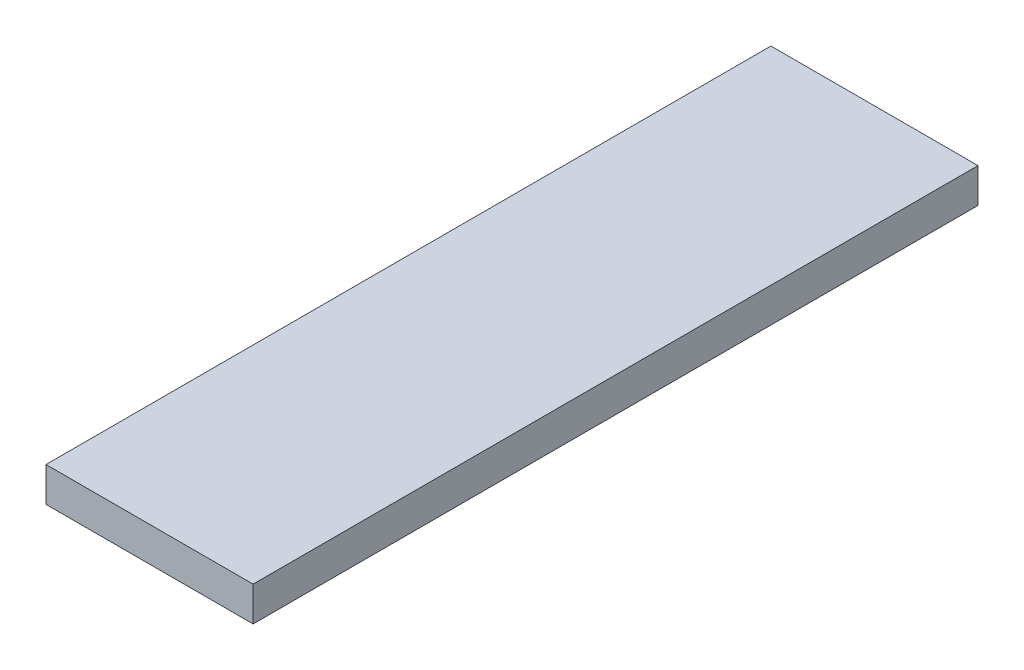
ISO-10303-21;
HEADER;
FILE_DESCRIPTION(('STEP AP214'),'2;1');
FILE_NAME('part.step','',(''),(''),'','','');
FILE_SCHEMA(('AUTOMOTIVE_DESIGN { 1 0 10303 214 1 1 1 1 }'));
ENDSEC;
DATA;
#1=APPLICATION_CONTEXT('core data for automotive mechanical design processes');
#2=APPLICATION_PROTOCOL_DEFINITION('international standard','automotive_design',2000,#1);
#3=PRODUCT_CONTEXT('',#1,'mechanical');
#4=PRODUCT('Part','Part','',(#3));
#5=PRODUCT_RELATED_PRODUCT_CATEGORY('part','',(#4));
#6=PRODUCT_DEFINITION_FORMATION('','',#4);
#7=PRODUCT_DEFINITION_CONTEXT('part definition',#1,'design');
#8=PRODUCT_DEFINITION('design','',#6,#7);
#9=PRODUCT_DEFINITION_SHAPE('','',#8);
#10=(LENGTH_UNIT() NAMED_UNIT(*) SI_UNIT(.MILLI.,.METRE.));
#11=(NAMED_UNIT(*) PLANE_ANGLE_UNIT() SI_UNIT($,.RADIAN.));
#12=(NAMED_UNIT(*) SI_UNIT($,.STERADIAN.) SOLID_ANGLE_UNIT());
#13=UNCERTAINTY_MEASURE_WITH_UNIT(LENGTH_MEASURE(1.E-05),#10,'distance_accuracy_value','');
#14=(GEOMETRIC_REPRESENTATION_CONTEXT(3) GLOBAL_UNCERTAINTY_ASSIGNED_CONTEXT((#13)) GLOBAL_UNIT_ASSIGNED_CONTEXT((#10,
#11,#12)) REPRESENTATION_CONTEXT('',''));
#15=CARTESIAN_POINT('',(0.,0.,0.));
#16=DIRECTION('',(0.,0.,1.));
#17=DIRECTION('',(1.,0.,0.));
#18=AXIS2_PLACEMENT_3D('',#15,#16,#17);
#19=CARTESIAN_POINT('',(0.,0.,53.34));
#20=DIRECTION('',(-1.,0.,0.));
#21=DIRECTION('',(0.,-1.,0.));
#22=AXIS2_PLACEMENT_3D('',#19,#20,#21);
#23=PLANE('',#22);
#24=DIRECTION('',(0.,1.,0.));
#25=VECTOR('',#24,1.);
#26=CARTESIAN_POINT('',(0.,0.,0.));
#27=LINE('',#26,#25);
#28=CARTESIAN_POINT('',(0.,0.,0.));
#29=VERTEX_POINT('',#28);
#30=CARTESIAN_POINT('',(0.,2.54,0.));
#31=VERTEX_POINT('',#30);
#32=EDGE_CURVE('E106',#29,#31,#27,.T.);
#33=ORIENTED_EDGE('',*,*,#32,.T.);
#34=DIRECTION('',(0.,0.,-1.));
#35=VECTOR('',#34,1.);
#36=CARTESIAN_POINT('',(0.,2.54,53.34));
#37=LINE('',#36,#35);
#38=CARTESIAN_POINT('',(0.,2.54,53.34));
#39=VERTEX_POINT('',#38);
#40=EDGE_CURVE('E11',#39,#31,#37,.T.);
#41=ORIENTED_EDGE('',*,*,#40,.F.);
#42=DIRECTION('',(0.,1.,0.));
#43=VECTOR('',#42,1.);
#44=CARTESIAN_POINT('',(0.,0.,53.34));
#45=LINE('',#44,#43);
#46=CARTESIAN_POINT('',(0.,0.,53.34));
#47=VERTEX_POINT('',#46);
#48=EDGE_CURVE('E90',#47,#39,#45,.T.);
#49=ORIENTED_EDGE('',*,*,#48,.F.);
#50=DIRECTION('',(0.,0.,-1.));
#51=VECTOR('',#50,1.);
#52=CARTESIAN_POINT('',(0.,0.,53.34));
#53=LINE('',#52,#51);
#54=EDGE_CURVE('E102',#47,#29,#53,.T.);
#55=ORIENTED_EDGE('',*,*,#54,.T.);
#56=EDGE_LOOP('',(#33,#41,#49,#55));
#57=FACE_BOUND('',#56,.T.);
#58=ADVANCED_FACE('F38',(#57),#23,.F.);
#59=CARTESIAN_POINT('',(0.,2.54,53.34));
#60=DIRECTION('',(0.,-1.,0.));
#61=DIRECTION('',(1.,0.,0.));
#62=AXIS2_PLACEMENT_3D('',#59,#60,#61);
#63=PLANE('',#62);
#64=DIRECTION('',(-1.,0.,0.));
#65=VECTOR('',#64,1.);
#66=CARTESIAN_POINT('',(0.,2.54,0.));
#67=LINE('',#66,#65);
#68=CARTESIAN_POINT('',(-15.24,2.54,0.));
#69=VERTEX_POINT('',#68);
#70=EDGE_CURVE('E95',#31,#69,#67,.T.);
#71=ORIENTED_EDGE('',*,*,#70,.T.);
#72=DIRECTION('',(0.,0.,-1.));
#73=VECTOR('',#72,1.);
#74=CARTESIAN_POINT('',(-15.24,2.54,53.34));
#75=LINE('',#74,#73);
#76=CARTESIAN_POINT('',(-15.24,2.54,53.34));
#77=VERTEX_POINT('',#76);
#78=EDGE_CURVE('E47',#77,#69,#75,.T.);
#79=ORIENTED_EDGE('',*,*,#78,.F.);
#80=DIRECTION('',(-1.,0.,0.));
#81=VECTOR('',#80,1.);
#82=CARTESIAN_POINT('',(0.,2.54,53.34));
#83=LINE('',#82,#81);
#84=EDGE_CURVE('E85',#39,#77,#83,.T.);
#85=ORIENTED_EDGE('',*,*,#84,.F.);
#86=ORIENTED_EDGE('',*,*,#40,.T.);
#87=EDGE_LOOP('',(#71,#79,#85,#86));
#88=FACE_BOUND('',#87,.T.);
#89=ADVANCED_FACE('F94',(#88),#63,.F.);
#90=CARTESIAN_POINT('',(-15.24,0.,53.34));
#91=DIRECTION('',(1.,0.,0.));
#92=DIRECTION('',(0.,0.,-1.));
#93=AXIS2_PLACEMENT_3D('',#90,#91,#92);
#94=PLANE('',#93);
#95=DIRECTION('',(0.,-1.,0.));
#96=VECTOR('',#95,1.);
#97=CARTESIAN_POINT('',(-15.24,0.,0.));
#98=LINE('',#97,#96);
#99=CARTESIAN_POINT('',(-15.24,0.,0.));
#100=VERTEX_POINT('',#99);
#101=EDGE_CURVE('E72',#69,#100,#98,.T.);
#102=ORIENTED_EDGE('',*,*,#101,.T.);
#103=DIRECTION('',(0.,0.,-1.));
#104=VECTOR('',#103,1.);
#105=CARTESIAN_POINT('',(-15.24,0.,53.34));
#106=LINE('',#105,#104);
#107=CARTESIAN_POINT('',(-15.24,0.,53.34));
#108=VERTEX_POINT('',#107);
#109=EDGE_CURVE('E97',#108,#100,#106,.T.);
#110=ORIENTED_EDGE('',*,*,#109,.F.);
#111=DIRECTION('',(0.,-1.,0.));
#112=VECTOR('',#111,1.);
#113=CARTESIAN_POINT('',(-15.24,0.,53.34));
#114=LINE('',#113,#112);
#115=EDGE_CURVE('E88',#77,#108,#114,.T.);
#116=ORIENTED_EDGE('',*,*,#115,.F.);
#117=ORIENTED_EDGE('',*,*,#78,.T.);
#118=EDGE_LOOP('',(#102,#110,#116,#117));
#119=FACE_BOUND('',#118,.T.);
#120=ADVANCED_FACE('F98',(#119),#94,.F.);
#121=CARTESIAN_POINT('',(0.,0.,53.34));
#122=DIRECTION('',(0.,1.,0.));
#123=DIRECTION('',(0.,0.,1.));
#124=AXIS2_PLACEMENT_3D('',#121,#122,#123);
#125=PLANE('',#124);
#126=DIRECTION('',(1.,0.,0.));
#127=VECTOR('',#126,1.);
#128=CARTESIAN_POINT('',(0.,0.,0.));
#129=LINE('',#128,#127);
#130=EDGE_CURVE('E78',#100,#29,#129,.T.);
#131=ORIENTED_EDGE('',*,*,#130,.T.);
#132=ORIENTED_EDGE('',*,*,#54,.F.);
#133=DIRECTION('',(1.,0.,0.));
#134=VECTOR('',#133,1.);
#135=CARTESIAN_POINT('',(0.,0.,53.34));
#136=LINE('',#135,#134);
#137=EDGE_CURVE('E55',#108,#47,#136,.T.);
#138=ORIENTED_EDGE('',*,*,#137,.F.);
#139=ORIENTED_EDGE('',*,*,#109,.T.);
#140=EDGE_LOOP('',(#131,#132,#138,#139));
#141=FACE_BOUND('',#140,.T.);
#142=ADVANCED_FACE('F119',(#141),#125,.F.);
#143=CARTESIAN_POINT('',(0.,0.,53.34));
#144=DIRECTION('',(0.,0.,1.));
#145=DIRECTION('',(1.,0.,0.));
#146=AXIS2_PLACEMENT_3D('',#143,#144,#145);
#147=PLANE('',#146);
#148=ORIENTED_EDGE('',*,*,#48,.T.);
#149=ORIENTED_EDGE('',*,*,#84,.T.);
#150=ORIENTED_EDGE('',*,*,#115,.T.);
#151=ORIENTED_EDGE('',*,*,#137,.T.);
#152=EDGE_LOOP('',(#148,#149,#150,#151));
#153=FACE_BOUND('',#152,.T.);
#154=ADVANCED_FACE('F86',(#153),#147,.T.);
#155=CARTESIAN_POINT('',(0.,0.,0.));
#156=DIRECTION('',(0.,0.,1.));
#157=DIRECTION('',(1.,0.,0.));
#158=AXIS2_PLACEMENT_3D('',#155,#156,#157);
#159=PLANE('',#158);
#160=ORIENTED_EDGE('',*,*,#32,.F.);
#161=ORIENTED_EDGE('',*,*,#130,.F.);
#162=ORIENTED_EDGE('',*,*,#101,.F.);
#163=ORIENTED_EDGE('',*,*,#70,.F.);
#164=EDGE_LOOP('',(#160,#161,#162,#163));
#165=FACE_BOUND('',#164,.T.);
#166=ADVANCED_FACE('F122',(#165),#159,.F.);
#167=CLOSED_SHELL('',(#58,#89,#120,#142,#154,#166));
#168=MANIFOLD_SOLID_BREP('B2',#167);
#169=ADVANCED_BREP_SHAPE_REPRESENTATION('',(#18,#168),#14);
#170=SHAPE_DEFINITION_REPRESENTATION(#9,#169);
ENDSEC;
END-ISO-10303-21;
